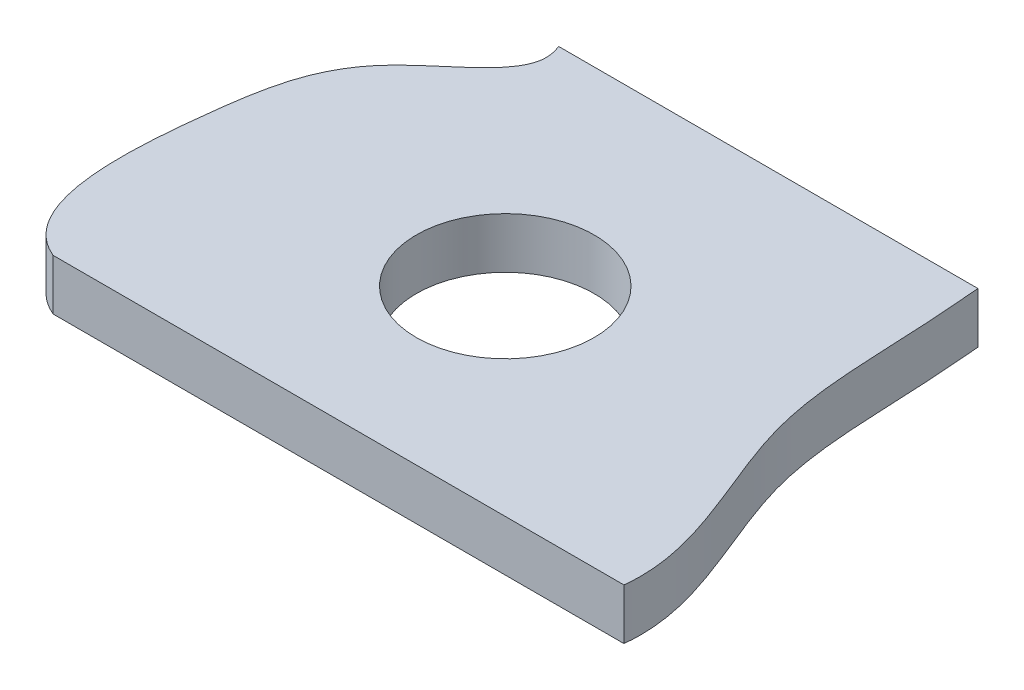
ISO-10303-21;
HEADER;
FILE_DESCRIPTION(('STEP AP214'),'2;1');
FILE_NAME('part.step','',(''),(''),'','','');
FILE_SCHEMA(('AUTOMOTIVE_DESIGN { 1 0 10303 214 1 1 1 1 }'));
ENDSEC;
DATA;
#1=APPLICATION_CONTEXT('core data for automotive mechanical design processes');
#2=APPLICATION_PROTOCOL_DEFINITION('international standard','automotive_design',2000,#1);
#3=PRODUCT_CONTEXT('',#1,'mechanical');
#4=PRODUCT('Part','Part','',(#3));
#5=PRODUCT_RELATED_PRODUCT_CATEGORY('part','',(#4));
#6=PRODUCT_DEFINITION_FORMATION('','',#4);
#7=PRODUCT_DEFINITION_CONTEXT('part definition',#1,'design');
#8=PRODUCT_DEFINITION('design','',#6,#7);
#9=PRODUCT_DEFINITION_SHAPE('','',#8);
#10=(LENGTH_UNIT() NAMED_UNIT(*) SI_UNIT(.MILLI.,.METRE.));
#11=(NAMED_UNIT(*) PLANE_ANGLE_UNIT() SI_UNIT($,.RADIAN.));
#12=(NAMED_UNIT(*) SI_UNIT($,.STERADIAN.) SOLID_ANGLE_UNIT());
#13=UNCERTAINTY_MEASURE_WITH_UNIT(LENGTH_MEASURE(1.E-05),#10,'distance_accuracy_value','');
#14=(GEOMETRIC_REPRESENTATION_CONTEXT(3) GLOBAL_UNCERTAINTY_ASSIGNED_CONTEXT((#13)) GLOBAL_UNIT_ASSIGNED_CONTEXT((#10,
#11,#12)) REPRESENTATION_CONTEXT('',''));
#15=CARTESIAN_POINT('',(0.,0.,0.));
#16=DIRECTION('',(0.,0.,1.));
#17=DIRECTION('',(1.,0.,0.));
#18=AXIS2_PLACEMENT_3D('',#15,#16,#17);
#19=CARTESIAN_POINT('',(-36.8402817499891,3.,-18.5736546365938));
#20=DIRECTION('',(0.,1.,0.));
#21=DIRECTION('',(0.,0.,1.));
#22=AXIS2_PLACEMENT_3D('',#19,#20,#21);
#23=PLANE('',#22);
#24=CARTESIAN_POINT('',(-58.5067825821639,3.,-38.58788382108));
#25=CARTESIAN_POINT('',(-59.6765525149452,3.,-36.0050947639689));
#26=CARTESIAN_POINT('',(-58.575510557798,3.,-28.258639933716));
#27=CARTESIAN_POINT('',(-58.9254363969779,3.,-17.1119651123871));
#28=CARTESIAN_POINT('',(-49.7054481849514,3.,-4.1277948681164));
#29=CARTESIAN_POINT('',(-72.0400884650551,3.,9.96470675227908));
#30=CARTESIAN_POINT('',(-44.5005984293608,3.,4.63134928451725));
#31=CARTESIAN_POINT('',(-29.3733584508808,3.,-0.777563949363168));
#32=CARTESIAN_POINT('',(-22.9731616643978,3.,-21.5903976356333));
#33=CARTESIAN_POINT('',(-30.3223364930831,3.,-42.9550365145497));
#34=CARTESIAN_POINT('',(-55.380407314743,3.,-45.4907521568377));
#35=CARTESIAN_POINT('',(-58.5067825821639,3.,-38.58788382108));
#36=B_SPLINE_CURVE_WITH_KNOTS('',3,(#24,#25,#26,#27,#28,#29,#30,#31,#32,#33,#34,#35),
.UNSPECIFIED.,.T.,.F.,(4,1,1,1,1,1,1,1,1,4),(0.,0.0668863554762576,0.137581528912982,
0.239375905363025,0.330501417757939,0.448637218346538,0.557955024887543,0.707331231722755,
0.821236773463909,1.),.UNSPECIFIED.);
#37=CARTESIAN_POINT('',(-59.1324053706406,3.,-31.7191220149733));
#38=VERTEX_POINT('',#37);
#39=CARTESIAN_POINT('',(-54.4330070977613,3.,-6.1212320990407));
#40=VERTEX_POINT('',#39);
#41=EDGE_CURVE('E47',#38,#40,#36,.T.);
#42=ORIENTED_EDGE('',*,*,#41,.F.);
#43=DIRECTION('',(1.,0.,0.));
#44=VECTOR('',#43,1.);
#45=CARTESIAN_POINT('',(-103.765736260605,3.,-31.7191220080417));
#46=LINE('',#45,#44);
#47=CARTESIAN_POINT('',(-83.8863442767859,3.,-31.7191220080395));
#48=VERTEX_POINT('',#47);
#49=EDGE_CURVE('E86',#48,#38,#46,.T.);
#50=ORIENTED_EDGE('',*,*,#49,.F.);
#51=CARTESIAN_POINT('',(-88.6899387920081,3.,-36.0101646817483));
#52=CARTESIAN_POINT('',(-98.5880153313157,3.,-41.2688512093636));
#53=CARTESIAN_POINT('',(-112.473599970242,3.,-31.2351191659474));
#54=CARTESIAN_POINT('',(-128.254843762134,3.,-14.5318364413557));
#55=CARTESIAN_POINT('',(-112.625080918205,3.,8.46616871194027));
#56=CARTESIAN_POINT('',(-70.3458843364597,3.,-7.40823847673667));
#57=CARTESIAN_POINT('',(-91.8905189110403,3.,-4.65681448092499));
#58=CARTESIAN_POINT('',(-91.0942824749801,3.,-17.3209238533094));
#59=CARTESIAN_POINT('',(-89.6446194214522,3.,-25.5029307288097));
#60=CARTESIAN_POINT('',(-81.0897848580636,3.,-30.4651718327906));
#61=CARTESIAN_POINT('',(-86.0711569220223,3.,-34.6188486130386));
#62=CARTESIAN_POINT('',(-88.6899387920081,3.,-36.0101646817483));
#63=B_SPLINE_CURVE_WITH_KNOTS('',3,(#51,#52,#53,#54,#55,#56,#57,#58,#59,#60,#61,#62),
.UNSPECIFIED.,.T.,.F.,(4,1,1,1,1,1,1,1,1,4),(0.,0.212832603588075,0.321350979327731,
0.479003872381427,0.694829706469253,0.741362093635828,0.833067540807257,0.894860133005139,
0.943689851113504,1.),.UNSPECIFIED.);
#64=CARTESIAN_POINT('',(-88.1263003150534,3.,-6.12123209875236));
#65=VERTEX_POINT('',#64);
#66=EDGE_CURVE('E79',#65,#48,#63,.T.);
#67=ORIENTED_EDGE('',*,*,#66,.F.);
#68=DIRECTION('',(-1.,0.,0.));
#69=VECTOR('',#68,1.);
#70=CARTESIAN_POINT('',(-114.23828482409,3.,-6.1212320990407));
#71=LINE('',#70,#69);
#72=EDGE_CURVE('E87',#40,#65,#71,.T.);
#73=ORIENTED_EDGE('',*,*,#72,.F.);
#74=EDGE_LOOP('',(#42,#50,#67,#73));
#75=FACE_BOUND('',#74,.T.);
#76=CARTESIAN_POINT('',(-73.2027786555246,3.,-17.8867961465188));
#77=DIRECTION('',(0.,1.,0.));
#78=DIRECTION('',(0.,0.,1.));
#79=AXIS2_PLACEMENT_3D('',#76,#77,#78);
#80=CIRCLE('',#79,5.25);
#81=CARTESIAN_POINT('',(-73.2027786555246,3.,-12.6367961465188));
#82=VERTEX_POINT('',#81);
#83=EDGE_CURVE('E92',#82,#82,#80,.T.);
#84=ORIENTED_EDGE('',*,*,#83,.F.);
#85=EDGE_LOOP('',(#84));
#86=FACE_BOUND('',#85,.T.);
#87=ADVANCED_FACE('F32',(#75,#86),#23,.T.);
#88=CARTESIAN_POINT('',(-36.8402817499891,0.,-18.5736546365938));
#89=DIRECTION('',(0.,1.,0.));
#90=DIRECTION('',(0.,0.,1.));
#91=AXIS2_PLACEMENT_3D('',#88,#89,#90);
#92=PLANE('',#91);
#93=CARTESIAN_POINT('',(-73.2027786555246,0.,-17.8867961465188));
#94=DIRECTION('',(0.,1.,0.));
#95=DIRECTION('',(0.,0.,1.));
#96=AXIS2_PLACEMENT_3D('',#93,#94,#95);
#97=CIRCLE('',#96,5.25);
#98=CARTESIAN_POINT('',(-73.2027786555246,0.,-12.6367961465188));
#99=VERTEX_POINT('',#98);
#100=EDGE_CURVE('E95',#99,#99,#97,.T.);
#101=ORIENTED_EDGE('',*,*,#100,.T.);
#102=EDGE_LOOP('',(#101));
#103=FACE_BOUND('',#102,.T.);
#104=DIRECTION('',(1.,0.,0.));
#105=VECTOR('',#104,1.);
#106=CARTESIAN_POINT('',(-36.8402817499891,0.,-31.7191220080417));
#107=LINE('',#106,#105);
#108=CARTESIAN_POINT('',(-83.8863442767859,0.,-31.7191220080395));
#109=VERTEX_POINT('',#108);
#110=CARTESIAN_POINT('',(-59.1324053706406,0.,-31.7191220149733));
#111=VERTEX_POINT('',#110);
#112=EDGE_CURVE('E101',#109,#111,#107,.T.);
#113=ORIENTED_EDGE('',*,*,#112,.T.);
#114=CARTESIAN_POINT('',(-58.5067825821639,0.,-38.58788382108));
#115=CARTESIAN_POINT('',(-59.6765525149452,0.,-36.0050947639689));
#116=CARTESIAN_POINT('',(-58.575510557798,0.,-28.258639933716));
#117=CARTESIAN_POINT('',(-58.9254363969779,0.,-17.1119651123871));
#118=CARTESIAN_POINT('',(-49.7054481849514,0.,-4.1277948681164));
#119=CARTESIAN_POINT('',(-72.0400884650551,0.,9.96470675227908));
#120=CARTESIAN_POINT('',(-44.5005984293608,0.,4.63134928451725));
#121=CARTESIAN_POINT('',(-29.3733584508808,0.,-0.777563949363168));
#122=CARTESIAN_POINT('',(-22.9731616643978,0.,-21.5903976356333));
#123=CARTESIAN_POINT('',(-30.3223364930831,0.,-42.9550365145497));
#124=CARTESIAN_POINT('',(-55.380407314743,0.,-45.4907521568377));
#125=CARTESIAN_POINT('',(-58.5067825821639,0.,-38.58788382108));
#126=B_SPLINE_CURVE_WITH_KNOTS('',3,(#114,#115,#116,#117,#118,#119,#120,#121,#122,#123,#124,
#125),.UNSPECIFIED.,.T.,.F.,(4,1,1,1,1,1,1,1,1,4),(0.,0.0668863554762576,0.137581528912982,
0.239375905363025,0.330501417757939,0.448637218346538,0.557955024887543,0.707331231722755,
0.821236773463909,1.),.UNSPECIFIED.);
#127=CARTESIAN_POINT('',(-54.4330070977613,0.,-6.12123209542829));
#128=VERTEX_POINT('',#127);
#129=EDGE_CURVE('E74',#111,#128,#126,.T.);
#130=ORIENTED_EDGE('',*,*,#129,.T.);
#131=DIRECTION('',(-1.,0.,0.));
#132=VECTOR('',#131,1.);
#133=CARTESIAN_POINT('',(-36.8402817499891,0.,-6.1212320990407));
#134=LINE('',#133,#132);
#135=CARTESIAN_POINT('',(-88.1263003150534,0.,-6.1212320990407));
#136=VERTEX_POINT('',#135);
#137=EDGE_CURVE('E54',#128,#136,#134,.T.);
#138=ORIENTED_EDGE('',*,*,#137,.T.);
#139=CARTESIAN_POINT('',(-88.6899387920081,0.,-36.0101646817483));
#140=CARTESIAN_POINT('',(-98.5880153313157,0.,-41.2688512093636));
#141=CARTESIAN_POINT('',(-112.473599970242,0.,-31.2351191659474));
#142=CARTESIAN_POINT('',(-128.254843762134,0.,-14.5318364413557));
#143=CARTESIAN_POINT('',(-112.625080918205,0.,8.46616871194027));
#144=CARTESIAN_POINT('',(-70.3458843364597,0.,-7.40823847673667));
#145=CARTESIAN_POINT('',(-91.8905189110403,0.,-4.65681448092499));
#146=CARTESIAN_POINT('',(-91.0942824749801,0.,-17.3209238533094));
#147=CARTESIAN_POINT('',(-89.6446194214522,0.,-25.5029307288097));
#148=CARTESIAN_POINT('',(-81.0897848580636,0.,-30.4651718327906));
#149=CARTESIAN_POINT('',(-86.0711569220223,0.,-34.6188486130386));
#150=CARTESIAN_POINT('',(-88.6899387920081,0.,-36.0101646817483));
#151=B_SPLINE_CURVE_WITH_KNOTS('',3,(#139,#140,#141,#142,#143,#144,#145,#146,#147,#148,#149,
#150),.UNSPECIFIED.,.T.,.F.,(4,1,1,1,1,1,1,1,1,4),(0.,0.212832603588075,0.321350979327731,
0.479003872381427,0.694829706469253,0.741362093635828,0.833067540807257,0.894860133005139,
0.943689851113504,1.),.UNSPECIFIED.);
#152=EDGE_CURVE('E110',#136,#109,#151,.T.);
#153=ORIENTED_EDGE('',*,*,#152,.T.);
#154=EDGE_LOOP('',(#113,#130,#138,#153));
#155=FACE_BOUND('',#154,.T.);
#156=ADVANCED_FACE('F34',(#103,#155),#92,.F.);
#157=CARTESIAN_POINT('',(-73.2027786555246,0.,-17.8867961465188));
#158=DIRECTION('',(0.,1.,0.));
#159=DIRECTION('',(0.,0.,1.));
#160=AXIS2_PLACEMENT_3D('',#157,#158,#159);
#161=CYLINDRICAL_SURFACE('',#160,5.25);
#162=ORIENTED_EDGE('',*,*,#100,.F.);
#163=EDGE_LOOP('',(#162));
#164=FACE_BOUND('',#163,.T.);
#165=ORIENTED_EDGE('',*,*,#83,.T.);
#166=EDGE_LOOP('',(#165));
#167=FACE_BOUND('',#166,.T.);
#168=ADVANCED_FACE('F133',(#164,#167),#161,.F.);
#169=CARTESIAN_POINT('',(-103.765736260605,0.,-31.7191220080417));
#170=DIRECTION('',(0.,0.,1.));
#171=DIRECTION('',(1.,0.,0.));
#172=AXIS2_PLACEMENT_3D('',#169,#170,#171);
#173=PLANE('',#172);
#174=ORIENTED_EDGE('',*,*,#49,.T.);
#175=DIRECTION('',(0.,1.,0.));
#176=VECTOR('',#175,1.);
#177=CARTESIAN_POINT('',(-59.1324053701615,0.,-31.7191220080417));
#178=LINE('',#177,#176);
#179=EDGE_CURVE('E72',#38,#111,#178,.F.);
#180=ORIENTED_EDGE('',*,*,#179,.T.);
#181=ORIENTED_EDGE('',*,*,#112,.F.);
#182=DIRECTION('',(0.,1.,0.));
#183=VECTOR('',#182,1.);
#184=CARTESIAN_POINT('',(-83.8863442767868,0.,-31.7191220080417));
#185=LINE('',#184,#183);
#186=EDGE_CURVE('E91',#109,#48,#185,.T.);
#187=ORIENTED_EDGE('',*,*,#186,.T.);
#188=EDGE_LOOP('',(#174,#180,#181,#187));
#189=FACE_BOUND('',#188,.T.);
#190=ADVANCED_FACE('F90',(#189),#173,.F.);
#191=CARTESIAN_POINT('',(-114.23828482409,0.,-6.1212320990407));
#192=DIRECTION('',(0.,0.,-1.));
#193=DIRECTION('',(-1.,0.,0.));
#194=AXIS2_PLACEMENT_3D('',#191,#192,#193);
#195=PLANE('',#194);
#196=ORIENTED_EDGE('',*,*,#137,.F.);
#197=DIRECTION('',(0.,1.,0.));
#198=VECTOR('',#197,1.);
#199=CARTESIAN_POINT('',(-54.4330070973522,0.,-6.1212320990407));
#200=LINE('',#199,#198);
#201=EDGE_CURVE('E11',#128,#40,#200,.T.);
#202=ORIENTED_EDGE('',*,*,#201,.T.);
#203=ORIENTED_EDGE('',*,*,#72,.T.);
#204=DIRECTION('',(0.,1.,0.));
#205=VECTOR('',#204,1.);
#206=CARTESIAN_POINT('',(-88.1263003157366,0.,-6.12123209903516));
#207=LINE('',#206,#205);
#208=EDGE_CURVE('E40',#65,#136,#207,.F.);
#209=ORIENTED_EDGE('',*,*,#208,.T.);
#210=EDGE_LOOP('',(#196,#202,#203,#209));
#211=FACE_BOUND('',#210,.T.);
#212=ADVANCED_FACE('F107',(#211),#195,.F.);
#213=DIRECTION('',(0.,1.,0.));
#214=VECTOR('',#213,1.);
#215=SURFACE_OF_LINEAR_EXTRUSION('',#151,#214);
#216=ORIENTED_EDGE('',*,*,#152,.F.);
#217=ORIENTED_EDGE('',*,*,#208,.F.);
#218=ORIENTED_EDGE('',*,*,#66,.T.);
#219=ORIENTED_EDGE('',*,*,#186,.F.);
#220=EDGE_LOOP('',(#216,#217,#218,#219));
#221=FACE_BOUND('',#220,.T.);
#222=ADVANCED_FACE('F109',(#221),#215,.F.);
#223=DIRECTION('',(0.,1.,0.));
#224=VECTOR('',#223,1.);
#225=SURFACE_OF_LINEAR_EXTRUSION('',#126,#224);
#226=ORIENTED_EDGE('',*,*,#41,.T.);
#227=ORIENTED_EDGE('',*,*,#201,.F.);
#228=ORIENTED_EDGE('',*,*,#129,.F.);
#229=ORIENTED_EDGE('',*,*,#179,.F.);
#230=EDGE_LOOP('',(#226,#227,#228,#229));
#231=FACE_BOUND('',#230,.T.);
#232=ADVANCED_FACE('F73',(#231),#225,.F.);
#233=CLOSED_SHELL('',(#87,#156,#168,#190,#212,#222,#232));
#234=MANIFOLD_SOLID_BREP('B2',#233);
#235=ADVANCED_BREP_SHAPE_REPRESENTATION('',(#18,#234),#14);
#236=SHAPE_DEFINITION_REPRESENTATION(#9,#235);
ENDSEC;
END-ISO-10303-21;
